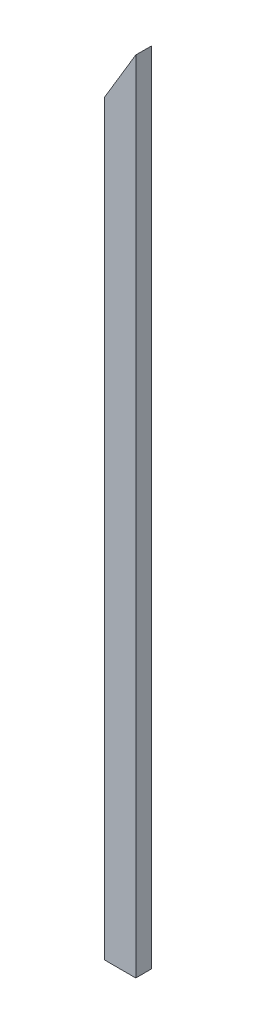
ISO-10303-21;
HEADER;
FILE_DESCRIPTION(('STEP AP214'),'2;1');
FILE_NAME('part.step','',(''),(''),'','','');
FILE_SCHEMA(('AUTOMOTIVE_DESIGN { 1 0 10303 214 1 1 1 1 }'));
ENDSEC;
DATA;
#1=APPLICATION_CONTEXT('core data for automotive mechanical design processes');
#2=APPLICATION_PROTOCOL_DEFINITION('international standard','automotive_design',2000,#1);
#3=PRODUCT_CONTEXT('',#1,'mechanical');
#4=PRODUCT('Part','Part','',(#3));
#5=PRODUCT_RELATED_PRODUCT_CATEGORY('part','',(#4));
#6=PRODUCT_DEFINITION_FORMATION('','',#4);
#7=PRODUCT_DEFINITION_CONTEXT('part definition',#1,'design');
#8=PRODUCT_DEFINITION('design','',#6,#7);
#9=PRODUCT_DEFINITION_SHAPE('','',#8);
#10=(LENGTH_UNIT() NAMED_UNIT(*) SI_UNIT(.MILLI.,.METRE.));
#11=(NAMED_UNIT(*) PLANE_ANGLE_UNIT() SI_UNIT($,.RADIAN.));
#12=(NAMED_UNIT(*) SI_UNIT($,.STERADIAN.) SOLID_ANGLE_UNIT());
#13=UNCERTAINTY_MEASURE_WITH_UNIT(LENGTH_MEASURE(1.E-05),#10,'distance_accuracy_value','');
#14=(GEOMETRIC_REPRESENTATION_CONTEXT(3) GLOBAL_UNCERTAINTY_ASSIGNED_CONTEXT((#13)) GLOBAL_UNIT_ASSIGNED_CONTEXT((#10,
#11,#12)) REPRESENTATION_CONTEXT('',''));
#15=CARTESIAN_POINT('',(0.,0.,0.));
#16=DIRECTION('',(0.,0.,1.));
#17=DIRECTION('',(1.,0.,0.));
#18=AXIS2_PLACEMENT_3D('',#15,#16,#17);
#19=CARTESIAN_POINT('',(-295.018375075988,474.810718135765,19.05));
#20=DIRECTION('',(1.,0.,0.));
#21=DIRECTION('',(0.,0.,-1.));
#22=AXIS2_PLACEMENT_3D('',#19,#20,#21);
#23=PLANE('',#22);
#24=DIRECTION('',(0.,-1.,0.));
#25=VECTOR('',#24,1.);
#26=CARTESIAN_POINT('',(-295.018375075988,474.810718135765,19.05));
#27=LINE('',#26,#25);
#28=CARTESIAN_POINT('',(-295.018375075988,411.150257019843,19.05));
#29=VERTEX_POINT('',#28);
#30=CARTESIAN_POINT('',(-295.018375075988,-505.603881864235,19.05));
#31=VERTEX_POINT('',#30);
#32=EDGE_CURVE('E101',#29,#31,#27,.T.);
#33=ORIENTED_EDGE('',*,*,#32,.F.);
#34=DIRECTION('',(0.,0.,1.));
#35=VECTOR('',#34,1.);
#36=CARTESIAN_POINT('',(-295.018375075988,411.150257019843,0.));
#37=LINE('',#36,#35);
#38=CARTESIAN_POINT('',(-295.018375075988,411.150257019843,0.));
#39=VERTEX_POINT('',#38);
#40=EDGE_CURVE('E97',#39,#29,#37,.T.);
#41=ORIENTED_EDGE('',*,*,#40,.F.);
#42=DIRECTION('',(0.,-1.,0.));
#43=VECTOR('',#42,1.);
#44=CARTESIAN_POINT('',(-295.018375075988,474.810718135765,0.));
#45=LINE('',#44,#43);
#46=CARTESIAN_POINT('',(-295.018375075988,-505.603881864235,0.));
#47=VERTEX_POINT('',#46);
#48=EDGE_CURVE('E95',#39,#47,#45,.T.);
#49=ORIENTED_EDGE('',*,*,#48,.T.);
#50=DIRECTION('',(0.,0.,-1.));
#51=VECTOR('',#50,1.);
#52=CARTESIAN_POINT('',(-295.018375075988,-505.603881864235,19.05));
#53=LINE('',#52,#51);
#54=EDGE_CURVE('E11',#31,#47,#53,.T.);
#55=ORIENTED_EDGE('',*,*,#54,.F.);
#56=EDGE_LOOP('',(#33,#41,#49,#55));
#57=FACE_BOUND('',#56,.T.);
#58=ADVANCED_FACE('F39',(#57),#23,.F.);
#59=CARTESIAN_POINT('',(-295.018375075988,-505.603881864235,19.05));
#60=DIRECTION('',(0.,1.,0.));
#61=DIRECTION('',(0.,0.,1.));
#62=AXIS2_PLACEMENT_3D('',#59,#60,#61);
#63=PLANE('',#62);
#64=DIRECTION('',(1.,0.,0.));
#65=VECTOR('',#64,1.);
#66=CARTESIAN_POINT('',(-295.018375075988,-505.603881864235,0.));
#67=LINE('',#66,#65);
#68=CARTESIAN_POINT('',(-256.918375075988,-505.603881864235,0.));
#69=VERTEX_POINT('',#68);
#70=EDGE_CURVE('E68',#47,#69,#67,.T.);
#71=ORIENTED_EDGE('',*,*,#70,.T.);
#72=DIRECTION('',(0.,0.,-1.));
#73=VECTOR('',#72,1.);
#74=CARTESIAN_POINT('',(-256.918375075988,-505.603881864235,19.05));
#75=LINE('',#74,#73);
#76=CARTESIAN_POINT('',(-256.918375075988,-505.603881864235,19.05));
#77=VERTEX_POINT('',#76);
#78=EDGE_CURVE('E48',#77,#69,#75,.T.);
#79=ORIENTED_EDGE('',*,*,#78,.F.);
#80=DIRECTION('',(1.,0.,0.));
#81=VECTOR('',#80,1.);
#82=CARTESIAN_POINT('',(-295.018375075988,-505.603881864235,19.05));
#83=LINE('',#82,#81);
#84=EDGE_CURVE('E56',#31,#77,#83,.T.);
#85=ORIENTED_EDGE('',*,*,#84,.F.);
#86=ORIENTED_EDGE('',*,*,#54,.T.);
#87=EDGE_LOOP('',(#71,#79,#85,#86));
#88=FACE_BOUND('',#87,.T.);
#89=ADVANCED_FACE('F124',(#88),#63,.F.);
#90=CARTESIAN_POINT('',(-256.918375075988,474.810718135765,19.05));
#91=DIRECTION('',(-1.,0.,0.));
#92=DIRECTION('',(0.,-1.,0.));
#93=AXIS2_PLACEMENT_3D('',#90,#91,#92);
#94=PLANE('',#93);
#95=DIRECTION('',(0.,1.,0.));
#96=VECTOR('',#95,1.);
#97=CARTESIAN_POINT('',(-256.918375075988,474.810718135765,0.));
#98=LINE('',#97,#96);
#99=CARTESIAN_POINT('',(-256.918375075988,474.810718135765,0.));
#100=VERTEX_POINT('',#99);
#101=EDGE_CURVE('E94',#69,#100,#98,.T.);
#102=ORIENTED_EDGE('',*,*,#101,.T.);
#103=DIRECTION('',(0.,0.,-1.));
#104=VECTOR('',#103,1.);
#105=CARTESIAN_POINT('',(-256.918375075988,474.810718135765,19.05));
#106=LINE('',#105,#104);
#107=CARTESIAN_POINT('',(-256.918375075988,474.810718135765,19.05));
#108=VERTEX_POINT('',#107);
#109=EDGE_CURVE('E75',#108,#100,#106,.T.);
#110=ORIENTED_EDGE('',*,*,#109,.F.);
#111=DIRECTION('',(0.,1.,0.));
#112=VECTOR('',#111,1.);
#113=CARTESIAN_POINT('',(-256.918375075988,474.810718135765,19.05));
#114=LINE('',#113,#112);
#115=EDGE_CURVE('E88',#77,#108,#114,.T.);
#116=ORIENTED_EDGE('',*,*,#115,.F.);
#117=ORIENTED_EDGE('',*,*,#78,.T.);
#118=EDGE_LOOP('',(#102,#110,#116,#117));
#119=FACE_BOUND('',#118,.T.);
#120=ADVANCED_FACE('F99',(#119),#94,.F.);
#121=CARTESIAN_POINT('',(0.,0.,19.05));
#122=DIRECTION('',(0.,0.,1.));
#123=DIRECTION('',(1.,0.,0.));
#124=AXIS2_PLACEMENT_3D('',#121,#122,#123);
#125=PLANE('',#124);
#126=DIRECTION('',(0.513541252058171,0.858064905723644,0.));
#127=VECTOR('',#126,1.);
#128=CARTESIAN_POINT('',(-295.018375075988,411.150257019843,19.05));
#129=LINE('',#128,#127);
#130=EDGE_CURVE('E83',#29,#108,#129,.T.);
#131=ORIENTED_EDGE('',*,*,#130,.F.);
#132=ORIENTED_EDGE('',*,*,#32,.T.);
#133=ORIENTED_EDGE('',*,*,#84,.T.);
#134=ORIENTED_EDGE('',*,*,#115,.T.);
#135=EDGE_LOOP('',(#131,#132,#133,#134));
#136=FACE_BOUND('',#135,.T.);
#137=ADVANCED_FACE('F123',(#136),#125,.T.);
#138=CARTESIAN_POINT('',(0.,0.,0.));
#139=DIRECTION('',(0.,0.,1.));
#140=DIRECTION('',(1.,0.,0.));
#141=AXIS2_PLACEMENT_3D('',#138,#139,#140);
#142=PLANE('',#141);
#143=ORIENTED_EDGE('',*,*,#48,.F.);
#144=DIRECTION('',(0.513541252058171,0.858064905723644,0.));
#145=VECTOR('',#144,1.);
#146=CARTESIAN_POINT('',(-295.018375075988,411.150257019843,0.));
#147=LINE('',#146,#145);
#148=EDGE_CURVE('E79',#39,#100,#147,.T.);
#149=ORIENTED_EDGE('',*,*,#148,.T.);
#150=ORIENTED_EDGE('',*,*,#101,.F.);
#151=ORIENTED_EDGE('',*,*,#70,.F.);
#152=EDGE_LOOP('',(#143,#149,#150,#151));
#153=FACE_BOUND('',#152,.T.);
#154=ADVANCED_FACE('F93',(#153),#142,.F.);
#155=CARTESIAN_POINT('',(-295.018375075988,411.150257019843,0.));
#156=DIRECTION('',(0.858064905723644,-0.513541252058171,0.));
#157=DIRECTION('',(0.513541252058171,0.858064905723644,0.));
#158=AXIS2_PLACEMENT_3D('',#155,#156,#157);
#159=PLANE('',#158);
#160=ORIENTED_EDGE('',*,*,#130,.T.);
#161=ORIENTED_EDGE('',*,*,#109,.T.);
#162=ORIENTED_EDGE('',*,*,#148,.F.);
#163=ORIENTED_EDGE('',*,*,#40,.T.);
#164=EDGE_LOOP('',(#160,#161,#162,#163));
#165=FACE_BOUND('',#164,.T.);
#166=ADVANCED_FACE('F77',(#165),#159,.F.);
#167=CLOSED_SHELL('',(#58,#89,#120,#137,#154,#166));
#168=MANIFOLD_SOLID_BREP('B2',#167);
#169=ADVANCED_BREP_SHAPE_REPRESENTATION('',(#18,#168),#14);
#170=SHAPE_DEFINITION_REPRESENTATION(#9,#169);
ENDSEC;
END-ISO-10303-21;
